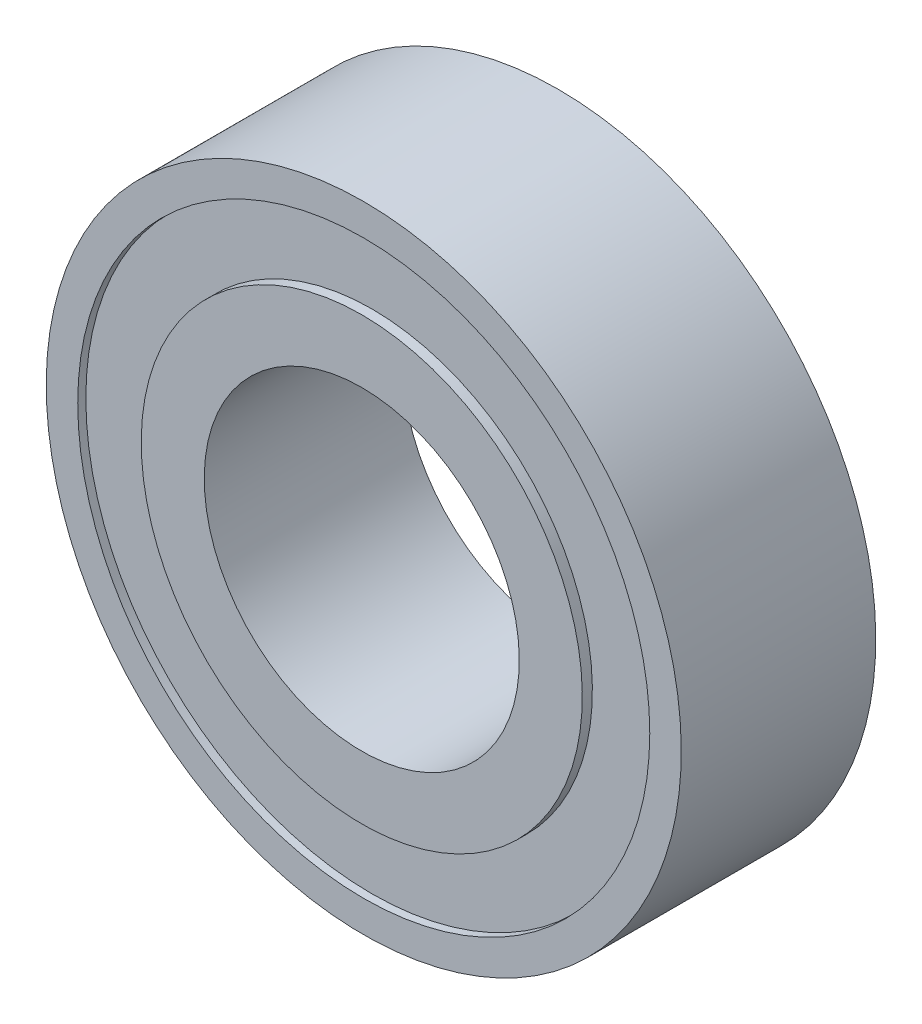
ISO-10303-21;
HEADER;
FILE_DESCRIPTION(('STEP AP214'),'2;1');
FILE_NAME('part.step','',(''),(''),'','','');
FILE_SCHEMA(('AUTOMOTIVE_DESIGN { 1 0 10303 214 1 1 1 1 }'));
ENDSEC;
DATA;
#1=APPLICATION_CONTEXT('core data for automotive mechanical design processes');
#2=APPLICATION_PROTOCOL_DEFINITION('international standard','automotive_design',2000,#1);
#3=PRODUCT_CONTEXT('',#1,'mechanical');
#4=PRODUCT('Part','Part','',(#3));
#5=PRODUCT_RELATED_PRODUCT_CATEGORY('part','',(#4));
#6=PRODUCT_DEFINITION_FORMATION('','',#4);
#7=PRODUCT_DEFINITION_CONTEXT('part definition',#1,'design');
#8=PRODUCT_DEFINITION('design','',#6,#7);
#9=PRODUCT_DEFINITION_SHAPE('','',#8);
#10=(LENGTH_UNIT() NAMED_UNIT(*) SI_UNIT(.MILLI.,.METRE.));
#11=(NAMED_UNIT(*) PLANE_ANGLE_UNIT() SI_UNIT($,.RADIAN.));
#12=(NAMED_UNIT(*) SI_UNIT($,.STERADIAN.) SOLID_ANGLE_UNIT());
#13=UNCERTAINTY_MEASURE_WITH_UNIT(LENGTH_MEASURE(1.E-05),#10,'distance_accuracy_value','');
#14=(GEOMETRIC_REPRESENTATION_CONTEXT(3) GLOBAL_UNCERTAINTY_ASSIGNED_CONTEXT((#13)) GLOBAL_UNIT_ASSIGNED_CONTEXT((#10,
#11,#12)) REPRESENTATION_CONTEXT('',''));
#15=CARTESIAN_POINT('',(0.,0.,0.));
#16=DIRECTION('',(0.,0.,1.));
#17=DIRECTION('',(1.,0.,0.));
#18=AXIS2_PLACEMENT_3D('',#15,#16,#17);
#19=CARTESIAN_POINT('',(0.,7.20625,0.0499999999999996));
#20=DIRECTION('',(0.,0.,-1.));
#21=DIRECTION('',(0.,1.,0.));
#22=AXIS2_PLACEMENT_3D('',#19,#20,#21);
#23=PLANE('',#22);
#24=CARTESIAN_POINT('',(0.,0.,0.0499999999999987));
#25=DIRECTION('',(0.,0.,-1.));
#26=DIRECTION('',(0.,1.,0.));
#27=AXIS2_PLACEMENT_3D('',#24,#25,#26);
#28=CIRCLE('',#27,8.);
#29=CARTESIAN_POINT('',(0.,8.,0.0499999999999997));
#30=VERTEX_POINT('',#29);
#31=EDGE_CURVE('E10',#30,#30,#28,.T.);
#32=ORIENTED_EDGE('',*,*,#31,.T.);
#33=EDGE_LOOP('',(#32));
#34=FACE_BOUND('',#33,.T.);
#35=CARTESIAN_POINT('',(0.,0.,0.0499999999999988));
#36=DIRECTION('',(0.,0.,-1.));
#37=DIRECTION('',(0.,1.,0.));
#38=AXIS2_PLACEMENT_3D('',#35,#36,#37);
#39=CIRCLE('',#38,7.20625);
#40=CARTESIAN_POINT('',(0.,7.20625,0.0499999999999997));
#41=VERTEX_POINT('',#40);
#42=EDGE_CURVE('E70',#41,#41,#39,.T.);
#43=ORIENTED_EDGE('',*,*,#42,.F.);
#44=EDGE_LOOP('',(#43));
#45=FACE_BOUND('',#44,.T.);
#46=ADVANCED_FACE('F30',(#34,#45),#23,.T.);
#47=CARTESIAN_POINT('',(0.,0.,0.));
#48=DIRECTION('',(0.,0.,-1.));
#49=DIRECTION('',(0.,1.,0.));
#50=AXIS2_PLACEMENT_3D('',#47,#48,#49);
#51=CYLINDRICAL_SURFACE('',#50,8.);
#52=CARTESIAN_POINT('',(0.,0.,4.95));
#53=DIRECTION('',(0.,0.,-1.));
#54=DIRECTION('',(0.,1.,0.));
#55=AXIS2_PLACEMENT_3D('',#52,#53,#54);
#56=CIRCLE('',#55,8.);
#57=CARTESIAN_POINT('',(0.,8.,4.95));
#58=VERTEX_POINT('',#57);
#59=EDGE_CURVE('E36',#58,#58,#56,.T.);
#60=ORIENTED_EDGE('',*,*,#59,.T.);
#61=EDGE_LOOP('',(#60));
#62=FACE_BOUND('',#61,.T.);
#63=ORIENTED_EDGE('',*,*,#31,.F.);
#64=EDGE_LOOP('',(#63));
#65=FACE_BOUND('',#64,.T.);
#66=ADVANCED_FACE('F78',(#62,#65),#51,.T.);
#67=CARTESIAN_POINT('',(0.,7.20625,4.95));
#68=DIRECTION('',(0.,0.,1.));
#69=DIRECTION('',(0.,-1.,0.));
#70=AXIS2_PLACEMENT_3D('',#67,#68,#69);
#71=PLANE('',#70);
#72=CARTESIAN_POINT('',(0.,0.,4.95));
#73=DIRECTION('',(0.,0.,-1.));
#74=DIRECTION('',(0.,1.,0.));
#75=AXIS2_PLACEMENT_3D('',#72,#73,#74);
#76=CIRCLE('',#75,7.20625);
#77=CARTESIAN_POINT('',(0.,7.20625,4.95));
#78=VERTEX_POINT('',#77);
#79=EDGE_CURVE('E40',#78,#78,#76,.T.);
#80=ORIENTED_EDGE('',*,*,#79,.T.);
#81=EDGE_LOOP('',(#80));
#82=FACE_BOUND('',#81,.T.);
#83=ORIENTED_EDGE('',*,*,#59,.F.);
#84=EDGE_LOOP('',(#83));
#85=FACE_BOUND('',#84,.T.);
#86=ADVANCED_FACE('F82',(#82,#85),#71,.T.);
#87=CARTESIAN_POINT('',(0.,0.,0.));
#88=DIRECTION('',(0.,0.,-1.));
#89=DIRECTION('',(0.,1.,0.));
#90=AXIS2_PLACEMENT_3D('',#87,#88,#89);
#91=CYLINDRICAL_SURFACE('',#90,7.20625);
#92=CARTESIAN_POINT('',(0.,0.,4.746));
#93=DIRECTION('',(0.,0.,-1.));
#94=DIRECTION('',(0.,1.,0.));
#95=AXIS2_PLACEMENT_3D('',#92,#93,#94);
#96=CIRCLE('',#95,7.20625);
#97=CARTESIAN_POINT('',(0.,7.20625,4.746));
#98=VERTEX_POINT('',#97);
#99=EDGE_CURVE('E44',#98,#98,#96,.T.);
#100=ORIENTED_EDGE('',*,*,#99,.T.);
#101=EDGE_LOOP('',(#100));
#102=FACE_BOUND('',#101,.T.);
#103=ORIENTED_EDGE('',*,*,#79,.F.);
#104=EDGE_LOOP('',(#103));
#105=FACE_BOUND('',#104,.T.);
#106=ADVANCED_FACE('F86',(#102,#105),#91,.F.);
#107=CARTESIAN_POINT('',(0.,5.55625,4.746));
#108=DIRECTION('',(0.,0.,1.));
#109=DIRECTION('',(0.,-1.,0.));
#110=AXIS2_PLACEMENT_3D('',#107,#108,#109);
#111=PLANE('',#110);
#112=CARTESIAN_POINT('',(0.,0.,4.746));
#113=DIRECTION('',(0.,0.,-1.));
#114=DIRECTION('',(0.,1.,0.));
#115=AXIS2_PLACEMENT_3D('',#112,#113,#114);
#116=CIRCLE('',#115,5.55625);
#117=CARTESIAN_POINT('',(0.,5.55625,4.746));
#118=VERTEX_POINT('',#117);
#119=EDGE_CURVE('E49',#118,#118,#116,.T.);
#120=ORIENTED_EDGE('',*,*,#119,.T.);
#121=EDGE_LOOP('',(#120));
#122=FACE_BOUND('',#121,.T.);
#123=ORIENTED_EDGE('',*,*,#99,.F.);
#124=EDGE_LOOP('',(#123));
#125=FACE_BOUND('',#124,.T.);
#126=ADVANCED_FACE('F93',(#122,#125),#111,.T.);
#127=CARTESIAN_POINT('',(0.,0.,0.));
#128=DIRECTION('',(0.,0.,-1.));
#129=DIRECTION('',(0.,1.,0.));
#130=AXIS2_PLACEMENT_3D('',#127,#128,#129);
#131=CYLINDRICAL_SURFACE('',#130,5.55625);
#132=CARTESIAN_POINT('',(0.,0.,5.));
#133=DIRECTION('',(0.,0.,-1.));
#134=DIRECTION('',(0.,1.,0.));
#135=AXIS2_PLACEMENT_3D('',#132,#133,#134);
#136=CIRCLE('',#135,5.55625);
#137=CARTESIAN_POINT('',(0.,5.55625,5.));
#138=VERTEX_POINT('',#137);
#139=EDGE_CURVE('E52',#138,#138,#136,.T.);
#140=ORIENTED_EDGE('',*,*,#139,.T.);
#141=EDGE_LOOP('',(#140));
#142=FACE_BOUND('',#141,.T.);
#143=ORIENTED_EDGE('',*,*,#119,.F.);
#144=EDGE_LOOP('',(#143));
#145=FACE_BOUND('',#144,.T.);
#146=ADVANCED_FACE('F97',(#142,#145),#131,.T.);
#147=CARTESIAN_POINT('',(0.,3.96875,5.));
#148=DIRECTION('',(0.,0.,1.));
#149=DIRECTION('',(0.,-1.,0.));
#150=AXIS2_PLACEMENT_3D('',#147,#148,#149);
#151=PLANE('',#150);
#152=CARTESIAN_POINT('',(0.,0.,5.));
#153=DIRECTION('',(0.,0.,-1.));
#154=DIRECTION('',(0.,1.,0.));
#155=AXIS2_PLACEMENT_3D('',#152,#153,#154);
#156=CIRCLE('',#155,3.96875);
#157=CARTESIAN_POINT('',(0.,3.96875,5.));
#158=VERTEX_POINT('',#157);
#159=EDGE_CURVE('E55',#158,#158,#156,.T.);
#160=ORIENTED_EDGE('',*,*,#159,.T.);
#161=EDGE_LOOP('',(#160));
#162=FACE_BOUND('',#161,.T.);
#163=ORIENTED_EDGE('',*,*,#139,.F.);
#164=EDGE_LOOP('',(#163));
#165=FACE_BOUND('',#164,.T.);
#166=ADVANCED_FACE('F101',(#162,#165),#151,.T.);
#167=CARTESIAN_POINT('',(0.,0.,0.));
#168=DIRECTION('',(0.,0.,-1.));
#169=DIRECTION('',(0.,1.,0.));
#170=AXIS2_PLACEMENT_3D('',#167,#168,#169);
#171=CYLINDRICAL_SURFACE('',#170,3.96875);
#172=CARTESIAN_POINT('',(0.,0.,0.));
#173=DIRECTION('',(0.,0.,-1.));
#174=DIRECTION('',(0.,1.,0.));
#175=AXIS2_PLACEMENT_3D('',#172,#173,#174);
#176=CIRCLE('',#175,3.96875);
#177=CARTESIAN_POINT('',(0.,3.96875,0.));
#178=VERTEX_POINT('',#177);
#179=EDGE_CURVE('E58',#178,#178,#176,.T.);
#180=ORIENTED_EDGE('',*,*,#179,.T.);
#181=EDGE_LOOP('',(#180));
#182=FACE_BOUND('',#181,.T.);
#183=ORIENTED_EDGE('',*,*,#159,.F.);
#184=EDGE_LOOP('',(#183));
#185=FACE_BOUND('',#184,.T.);
#186=ADVANCED_FACE('F105',(#182,#185),#171,.F.);
#187=CARTESIAN_POINT('',(0.,3.96875,0.));
#188=DIRECTION('',(0.,0.,-1.));
#189=DIRECTION('',(0.,1.,0.));
#190=AXIS2_PLACEMENT_3D('',#187,#188,#189);
#191=PLANE('',#190);
#192=CARTESIAN_POINT('',(0.,0.,0.));
#193=DIRECTION('',(0.,0.,-1.));
#194=DIRECTION('',(0.,1.,0.));
#195=AXIS2_PLACEMENT_3D('',#192,#193,#194);
#196=CIRCLE('',#195,5.55625);
#197=CARTESIAN_POINT('',(0.,5.55625,0.));
#198=VERTEX_POINT('',#197);
#199=EDGE_CURVE('E61',#198,#198,#196,.T.);
#200=ORIENTED_EDGE('',*,*,#199,.T.);
#201=EDGE_LOOP('',(#200));
#202=FACE_BOUND('',#201,.T.);
#203=ORIENTED_EDGE('',*,*,#179,.F.);
#204=EDGE_LOOP('',(#203));
#205=FACE_BOUND('',#204,.T.);
#206=ADVANCED_FACE('F109',(#202,#205),#191,.T.);
#207=CARTESIAN_POINT('',(0.,0.,0.));
#208=DIRECTION('',(0.,0.,-1.));
#209=DIRECTION('',(0.,1.,0.));
#210=AXIS2_PLACEMENT_3D('',#207,#208,#209);
#211=CYLINDRICAL_SURFACE('',#210,5.55625);
#212=CARTESIAN_POINT('',(0.,0.,0.253999999999999));
#213=DIRECTION('',(0.,0.,-1.));
#214=DIRECTION('',(0.,1.,0.));
#215=AXIS2_PLACEMENT_3D('',#212,#213,#214);
#216=CIRCLE('',#215,5.55625);
#217=CARTESIAN_POINT('',(0.,5.55625,0.254));
#218=VERTEX_POINT('',#217);
#219=EDGE_CURVE('E64',#218,#218,#216,.T.);
#220=ORIENTED_EDGE('',*,*,#219,.T.);
#221=EDGE_LOOP('',(#220));
#222=FACE_BOUND('',#221,.T.);
#223=ORIENTED_EDGE('',*,*,#199,.F.);
#224=EDGE_LOOP('',(#223));
#225=FACE_BOUND('',#224,.T.);
#226=ADVANCED_FACE('F113',(#222,#225),#211,.T.);
#227=CARTESIAN_POINT('',(0.,5.55625,0.254));
#228=DIRECTION('',(0.,0.,-1.));
#229=DIRECTION('',(0.,1.,0.));
#230=AXIS2_PLACEMENT_3D('',#227,#228,#229);
#231=PLANE('',#230);
#232=CARTESIAN_POINT('',(0.,0.,0.253999999999999));
#233=DIRECTION('',(0.,0.,-1.));
#234=DIRECTION('',(0.,1.,0.));
#235=AXIS2_PLACEMENT_3D('',#232,#233,#234);
#236=CIRCLE('',#235,7.20625);
#237=CARTESIAN_POINT('',(0.,7.20625,0.254));
#238=VERTEX_POINT('',#237);
#239=EDGE_CURVE('E67',#238,#238,#236,.T.);
#240=ORIENTED_EDGE('',*,*,#239,.T.);
#241=EDGE_LOOP('',(#240));
#242=FACE_BOUND('',#241,.T.);
#243=ORIENTED_EDGE('',*,*,#219,.F.);
#244=EDGE_LOOP('',(#243));
#245=FACE_BOUND('',#244,.T.);
#246=ADVANCED_FACE('F117',(#242,#245),#231,.T.);
#247=CARTESIAN_POINT('',(0.,0.,0.));
#248=DIRECTION('',(0.,0.,-1.));
#249=DIRECTION('',(0.,1.,0.));
#250=AXIS2_PLACEMENT_3D('',#247,#248,#249);
#251=CYLINDRICAL_SURFACE('',#250,7.20625);
#252=ORIENTED_EDGE('',*,*,#42,.T.);
#253=EDGE_LOOP('',(#252));
#254=FACE_BOUND('',#253,.T.);
#255=ORIENTED_EDGE('',*,*,#239,.F.);
#256=EDGE_LOOP('',(#255));
#257=FACE_BOUND('',#256,.T.);
#258=ADVANCED_FACE('F74',(#254,#257),#251,.F.);
#259=CLOSED_SHELL('',(#46,#66,#86,#106,#126,#146,#166,#186,#206,#226,#246,#258));
#260=MANIFOLD_SOLID_BREP('B2',#259);
#261=ADVANCED_BREP_SHAPE_REPRESENTATION('',(#18,#260),#14);
#262=SHAPE_DEFINITION_REPRESENTATION(#9,#261);
ENDSEC;
END-ISO-10303-21;
